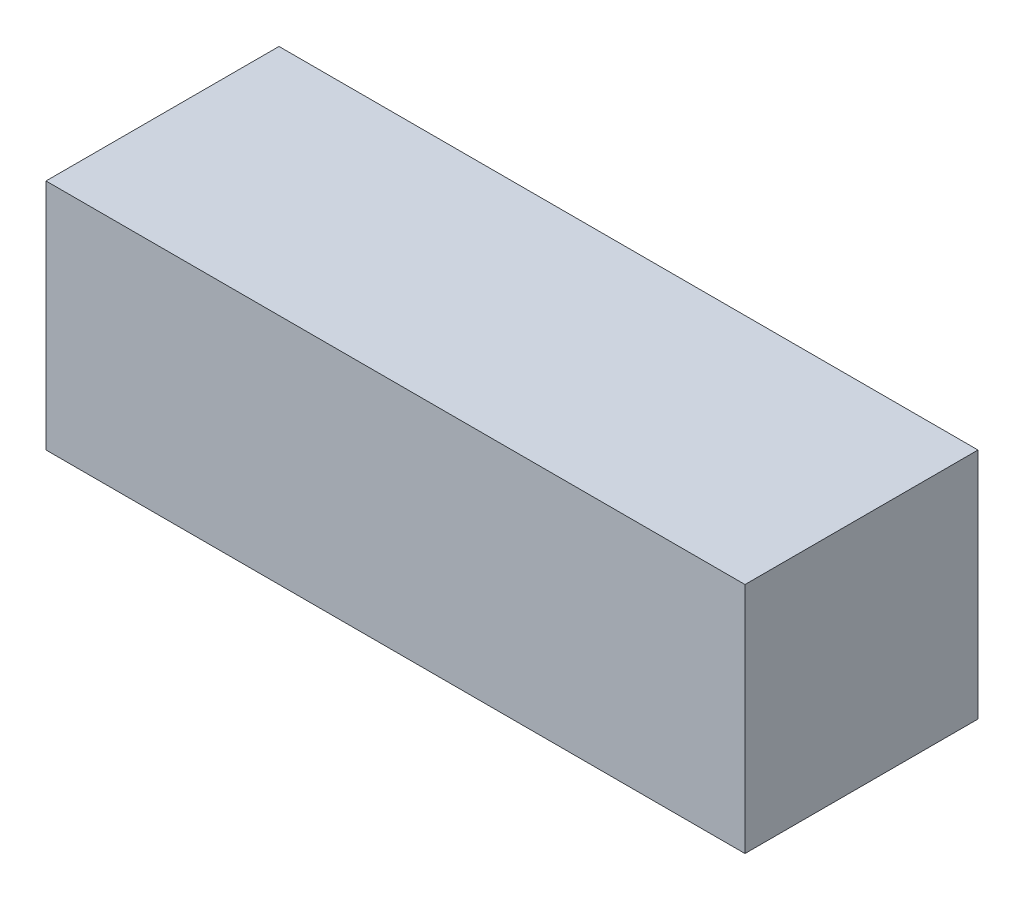
ISO-10303-21;
HEADER;
FILE_DESCRIPTION(('STEP AP214'),'2;1');
FILE_NAME('part.step','',(''),(''),'','','');
FILE_SCHEMA(('AUTOMOTIVE_DESIGN { 1 0 10303 214 1 1 1 1 }'));
ENDSEC;
DATA;
#1=APPLICATION_CONTEXT('core data for automotive mechanical design processes');
#2=APPLICATION_PROTOCOL_DEFINITION('international standard','automotive_design',2000,#1);
#3=PRODUCT_CONTEXT('',#1,'mechanical');
#4=PRODUCT('Part','Part','',(#3));
#5=PRODUCT_RELATED_PRODUCT_CATEGORY('part','',(#4));
#6=PRODUCT_DEFINITION_FORMATION('','',#4);
#7=PRODUCT_DEFINITION_CONTEXT('part definition',#1,'design');
#8=PRODUCT_DEFINITION('design','',#6,#7);
#9=PRODUCT_DEFINITION_SHAPE('','',#8);
#10=(LENGTH_UNIT() NAMED_UNIT(*) SI_UNIT(.MILLI.,.METRE.));
#11=(NAMED_UNIT(*) PLANE_ANGLE_UNIT() SI_UNIT($,.RADIAN.));
#12=(NAMED_UNIT(*) SI_UNIT($,.STERADIAN.) SOLID_ANGLE_UNIT());
#13=UNCERTAINTY_MEASURE_WITH_UNIT(LENGTH_MEASURE(1.E-05),#10,'distance_accuracy_value','');
#14=(GEOMETRIC_REPRESENTATION_CONTEXT(3) GLOBAL_UNCERTAINTY_ASSIGNED_CONTEXT((#13)) GLOBAL_UNIT_ASSIGNED_CONTEXT((#10,
#11,#12)) REPRESENTATION_CONTEXT('',''));
#15=CARTESIAN_POINT('',(0.,0.,0.));
#16=DIRECTION('',(0.,0.,1.));
#17=DIRECTION('',(1.,0.,0.));
#18=AXIS2_PLACEMENT_3D('',#15,#16,#17);
#19=CARTESIAN_POINT('',(0.,0.,100.));
#20=DIRECTION('',(1.,0.,0.));
#21=DIRECTION('',(0.,0.,-1.));
#22=AXIS2_PLACEMENT_3D('',#19,#20,#21);
#23=PLANE('',#22);
#24=DIRECTION('',(0.,-1.,0.));
#25=VECTOR('',#24,1.);
#26=CARTESIAN_POINT('',(0.,0.,0.));
#27=LINE('',#26,#25);
#28=CARTESIAN_POINT('',(0.,100.,0.));
#29=VERTEX_POINT('',#28);
#30=CARTESIAN_POINT('',(0.,0.,0.));
#31=VERTEX_POINT('',#30);
#32=EDGE_CURVE('E106',#29,#31,#27,.T.);
#33=ORIENTED_EDGE('',*,*,#32,.T.);
#34=DIRECTION('',(0.,0.,-1.));
#35=VECTOR('',#34,1.);
#36=CARTESIAN_POINT('',(0.,0.,100.));
#37=LINE('',#36,#35);
#38=CARTESIAN_POINT('',(0.,0.,100.));
#39=VERTEX_POINT('',#38);
#40=EDGE_CURVE('E11',#39,#31,#37,.T.);
#41=ORIENTED_EDGE('',*,*,#40,.F.);
#42=DIRECTION('',(0.,-1.,0.));
#43=VECTOR('',#42,1.);
#44=CARTESIAN_POINT('',(0.,0.,100.));
#45=LINE('',#44,#43);
#46=CARTESIAN_POINT('',(0.,100.,100.));
#47=VERTEX_POINT('',#46);
#48=EDGE_CURVE('E94',#47,#39,#45,.T.);
#49=ORIENTED_EDGE('',*,*,#48,.F.);
#50=DIRECTION('',(0.,0.,-1.));
#51=VECTOR('',#50,1.);
#52=CARTESIAN_POINT('',(0.,100.,100.));
#53=LINE('',#52,#51);
#54=EDGE_CURVE('E102',#47,#29,#53,.T.);
#55=ORIENTED_EDGE('',*,*,#54,.T.);
#56=EDGE_LOOP('',(#33,#41,#49,#55));
#57=FACE_BOUND('',#56,.T.);
#58=ADVANCED_FACE('F43',(#57),#23,.F.);
#59=CARTESIAN_POINT('',(0.,0.,100.));
#60=DIRECTION('',(0.,1.,0.));
#61=DIRECTION('',(0.,0.,1.));
#62=AXIS2_PLACEMENT_3D('',#59,#60,#61);
#63=PLANE('',#62);
#64=DIRECTION('',(1.,0.,0.));
#65=VECTOR('',#64,1.);
#66=CARTESIAN_POINT('',(0.,0.,0.));
#67=LINE('',#66,#65);
#68=CARTESIAN_POINT('',(300.,0.,0.));
#69=VERTEX_POINT('',#68);
#70=EDGE_CURVE('E98',#31,#69,#67,.T.);
#71=ORIENTED_EDGE('',*,*,#70,.T.);
#72=DIRECTION('',(0.,0.,-1.));
#73=VECTOR('',#72,1.);
#74=CARTESIAN_POINT('',(300.,0.,100.));
#75=LINE('',#74,#73);
#76=CARTESIAN_POINT('',(300.,0.,100.));
#77=VERTEX_POINT('',#76);
#78=EDGE_CURVE('E51',#77,#69,#75,.T.);
#79=ORIENTED_EDGE('',*,*,#78,.F.);
#80=DIRECTION('',(1.,0.,0.));
#81=VECTOR('',#80,1.);
#82=CARTESIAN_POINT('',(0.,0.,100.));
#83=LINE('',#82,#81);
#84=EDGE_CURVE('E89',#39,#77,#83,.T.);
#85=ORIENTED_EDGE('',*,*,#84,.F.);
#86=ORIENTED_EDGE('',*,*,#40,.T.);
#87=EDGE_LOOP('',(#71,#79,#85,#86));
#88=FACE_BOUND('',#87,.T.);
#89=ADVANCED_FACE('F97',(#88),#63,.F.);
#90=CARTESIAN_POINT('',(300.,0.,100.));
#91=DIRECTION('',(-1.,0.,0.));
#92=DIRECTION('',(0.,0.,1.));
#93=AXIS2_PLACEMENT_3D('',#90,#91,#92);
#94=PLANE('',#93);
#95=DIRECTION('',(0.,1.,0.));
#96=VECTOR('',#95,1.);
#97=CARTESIAN_POINT('',(300.,0.,0.));
#98=LINE('',#97,#96);
#99=CARTESIAN_POINT('',(300.,100.,0.));
#100=VERTEX_POINT('',#99);
#101=EDGE_CURVE('E76',#69,#100,#98,.T.);
#102=ORIENTED_EDGE('',*,*,#101,.T.);
#103=DIRECTION('',(0.,0.,-1.));
#104=VECTOR('',#103,1.);
#105=CARTESIAN_POINT('',(300.,100.,100.));
#106=LINE('',#105,#104);
#107=CARTESIAN_POINT('',(300.,100.,100.));
#108=VERTEX_POINT('',#107);
#109=EDGE_CURVE('E99',#108,#100,#106,.T.);
#110=ORIENTED_EDGE('',*,*,#109,.F.);
#111=DIRECTION('',(0.,1.,0.));
#112=VECTOR('',#111,1.);
#113=CARTESIAN_POINT('',(300.,0.,100.));
#114=LINE('',#113,#112);
#115=EDGE_CURVE('E92',#77,#108,#114,.T.);
#116=ORIENTED_EDGE('',*,*,#115,.F.);
#117=ORIENTED_EDGE('',*,*,#78,.T.);
#118=EDGE_LOOP('',(#102,#110,#116,#117));
#119=FACE_BOUND('',#118,.T.);
#120=ADVANCED_FACE('F100',(#119),#94,.F.);
#121=CARTESIAN_POINT('',(0.,100.,100.));
#122=DIRECTION('',(0.,-1.,0.));
#123=DIRECTION('',(0.,0.,-1.));
#124=AXIS2_PLACEMENT_3D('',#121,#122,#123);
#125=PLANE('',#124);
#126=DIRECTION('',(-1.,0.,0.));
#127=VECTOR('',#126,1.);
#128=CARTESIAN_POINT('',(0.,100.,0.));
#129=LINE('',#128,#127);
#130=EDGE_CURVE('E82',#100,#29,#129,.T.);
#131=ORIENTED_EDGE('',*,*,#130,.T.);
#132=ORIENTED_EDGE('',*,*,#54,.F.);
#133=DIRECTION('',(-1.,0.,0.));
#134=VECTOR('',#133,1.);
#135=CARTESIAN_POINT('',(0.,100.,100.));
#136=LINE('',#135,#134);
#137=EDGE_CURVE('E59',#108,#47,#136,.T.);
#138=ORIENTED_EDGE('',*,*,#137,.F.);
#139=ORIENTED_EDGE('',*,*,#109,.T.);
#140=EDGE_LOOP('',(#131,#132,#138,#139));
#141=FACE_BOUND('',#140,.T.);
#142=ADVANCED_FACE('F113',(#141),#125,.F.);
#143=CARTESIAN_POINT('',(0.,0.,100.));
#144=DIRECTION('',(0.,0.,-1.));
#145=DIRECTION('',(-1.,0.,0.));
#146=AXIS2_PLACEMENT_3D('',#143,#144,#145);
#147=PLANE('',#146);
#148=ORIENTED_EDGE('',*,*,#48,.T.);
#149=ORIENTED_EDGE('',*,*,#84,.T.);
#150=ORIENTED_EDGE('',*,*,#115,.T.);
#151=ORIENTED_EDGE('',*,*,#137,.T.);
#152=EDGE_LOOP('',(#148,#149,#150,#151));
#153=FACE_BOUND('',#152,.T.);
#154=ADVANCED_FACE('F90',(#153),#147,.F.);
#155=CARTESIAN_POINT('',(0.,0.,0.));
#156=DIRECTION('',(0.,0.,-1.));
#157=DIRECTION('',(-1.,0.,0.));
#158=AXIS2_PLACEMENT_3D('',#155,#156,#157);
#159=PLANE('',#158);
#160=ORIENTED_EDGE('',*,*,#32,.F.);
#161=ORIENTED_EDGE('',*,*,#130,.F.);
#162=ORIENTED_EDGE('',*,*,#101,.F.);
#163=ORIENTED_EDGE('',*,*,#70,.F.);
#164=EDGE_LOOP('',(#160,#161,#162,#163));
#165=FACE_BOUND('',#164,.T.);
#166=ADVANCED_FACE('F116',(#165),#159,.T.);
#167=CLOSED_SHELL('',(#58,#89,#120,#142,#154,#166));
#168=MANIFOLD_SOLID_BREP('B2',#167);
#169=ADVANCED_BREP_SHAPE_REPRESENTATION('',(#18,#168),#14);
#170=SHAPE_DEFINITION_REPRESENTATION(#9,#169);
ENDSEC;
END-ISO-10303-21;
